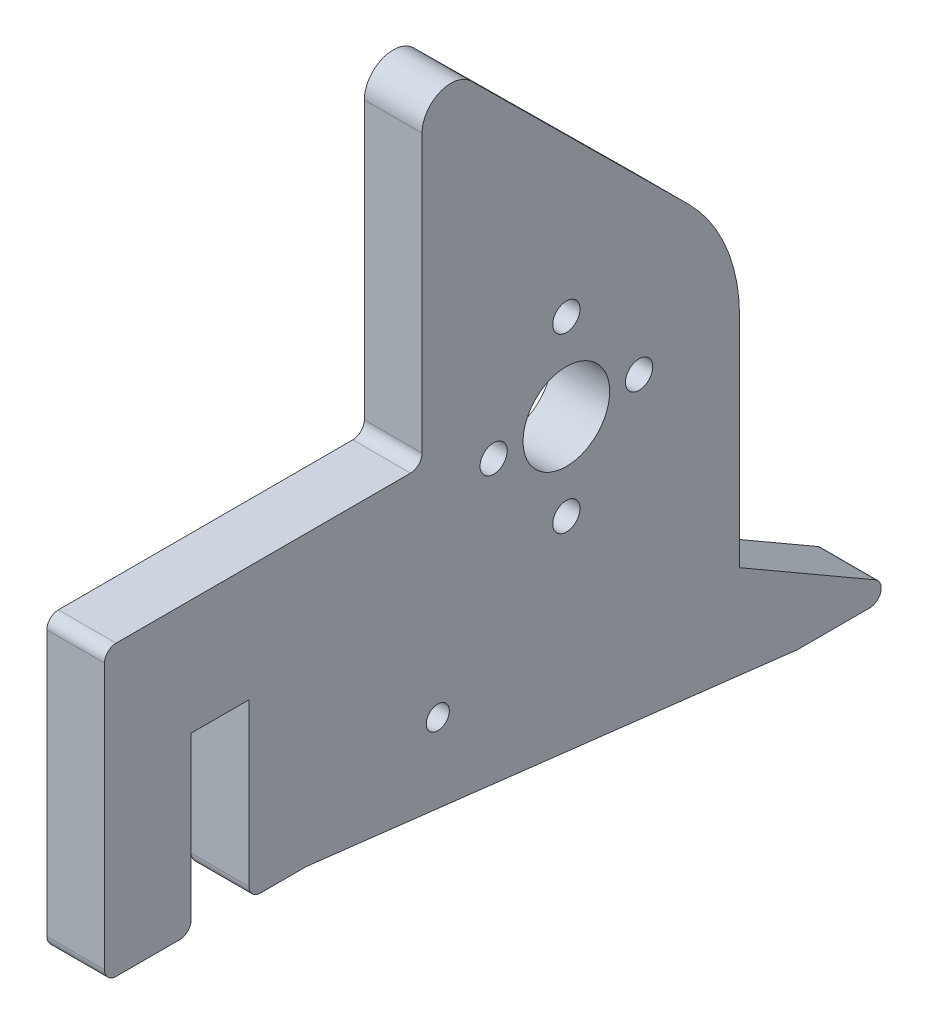
ISO-10303-21;
HEADER;
FILE_DESCRIPTION(('STEP AP214'),'2;1');
FILE_NAME('part.step','',(''),(''),'','','');
FILE_SCHEMA(('AUTOMOTIVE_DESIGN { 1 0 10303 214 1 1 1 1 }'));
ENDSEC;
DATA;
#1=APPLICATION_CONTEXT('core data for automotive mechanical design processes');
#2=APPLICATION_PROTOCOL_DEFINITION('international standard','automotive_design',2000,#1);
#3=PRODUCT_CONTEXT('',#1,'mechanical');
#4=PRODUCT('Part','Part','',(#3));
#5=PRODUCT_RELATED_PRODUCT_CATEGORY('part','',(#4));
#6=PRODUCT_DEFINITION_FORMATION('','',#4);
#7=PRODUCT_DEFINITION_CONTEXT('part definition',#1,'design');
#8=PRODUCT_DEFINITION('design','',#6,#7);
#9=PRODUCT_DEFINITION_SHAPE('','',#8);
#10=(LENGTH_UNIT() NAMED_UNIT(*) SI_UNIT(.MILLI.,.METRE.));
#11=(NAMED_UNIT(*) PLANE_ANGLE_UNIT() SI_UNIT($,.RADIAN.));
#12=(NAMED_UNIT(*) SI_UNIT($,.STERADIAN.) SOLID_ANGLE_UNIT());
#13=UNCERTAINTY_MEASURE_WITH_UNIT(LENGTH_MEASURE(1.E-05),#10,'distance_accuracy_value','');
#14=(GEOMETRIC_REPRESENTATION_CONTEXT(3) GLOBAL_UNCERTAINTY_ASSIGNED_CONTEXT((#13)) GLOBAL_UNIT_ASSIGNED_CONTEXT((#10,
#11,#12)) REPRESENTATION_CONTEXT('',''));
#15=CARTESIAN_POINT('',(0.,0.,0.));
#16=DIRECTION('',(0.,0.,1.));
#17=DIRECTION('',(1.,0.,0.));
#18=AXIS2_PLACEMENT_3D('',#15,#16,#17);
#19=CARTESIAN_POINT('',(3.175,-28.575,50.8));
#20=DIRECTION('',(0.,1.,0.));
#21=DIRECTION('',(0.,0.,1.));
#22=AXIS2_PLACEMENT_3D('',#19,#20,#21);
#23=PLANE('',#22);
#24=DIRECTION('',(0.,0.,-1.));
#25=VECTOR('',#24,1.);
#26=CARTESIAN_POINT('',(-3.175,-28.575,50.8));
#27=LINE('',#26,#25);
#28=CARTESIAN_POINT('',(-3.175,-28.575,49.53));
#29=VERTEX_POINT('',#28);
#30=CARTESIAN_POINT('',(-3.175,-28.575,42.545));
#31=VERTEX_POINT('',#30);
#32=EDGE_CURVE('E259',#29,#31,#27,.T.);
#33=ORIENTED_EDGE('',*,*,#32,.T.);
#34=DIRECTION('',(1.,0.,0.));
#35=VECTOR('',#34,1.);
#36=CARTESIAN_POINT('',(3.175,-28.575,42.545));
#37=LINE('',#36,#35);
#38=CARTESIAN_POINT('',(3.175,-28.575,42.545));
#39=VERTEX_POINT('',#38);
#40=EDGE_CURVE('E316',#31,#39,#37,.T.);
#41=ORIENTED_EDGE('',*,*,#40,.T.);
#42=DIRECTION('',(0.,0.,-1.));
#43=VECTOR('',#42,1.);
#44=CARTESIAN_POINT('',(3.175,-28.575,50.8));
#45=LINE('',#44,#43);
#46=CARTESIAN_POINT('',(3.175,-28.575,49.53));
#47=VERTEX_POINT('',#46);
#48=EDGE_CURVE('E235',#47,#39,#45,.T.);
#49=ORIENTED_EDGE('',*,*,#48,.F.);
#50=DIRECTION('',(-1.,0.,0.));
#51=VECTOR('',#50,1.);
#52=CARTESIAN_POINT('',(3.175,-28.575,49.53));
#53=LINE('',#52,#51);
#54=EDGE_CURVE('E313',#47,#29,#53,.T.);
#55=ORIENTED_EDGE('',*,*,#54,.T.);
#56=EDGE_LOOP('',(#33,#41,#49,#55));
#57=FACE_BOUND('',#56,.T.);
#58=ADVANCED_FACE('F35',(#57),#23,.F.);
#59=CARTESIAN_POINT('',(3.175,-34.925,-38.1));
#60=DIRECTION('',(0.,-0.866025403784442,0.499999999999995));
#61=DIRECTION('',(0.,-0.499999999999995,-0.866025403784442));
#62=AXIS2_PLACEMENT_3D('',#59,#60,#61);
#63=PLANE('',#62);
#64=DIRECTION('',(0.,0.499999999999995,0.866025403784442));
#65=VECTOR('',#64,1.);
#66=CARTESIAN_POINT('',(3.175,-34.925,-38.1));
#67=LINE('',#66,#65);
#68=CARTESIAN_POINT('',(3.175,-32.5551477371938,-33.9952954743875));
#69=VERTEX_POINT('',#68);
#70=CARTESIAN_POINT('',(3.175,-23.9264773719378,-19.05));
#71=VERTEX_POINT('',#70);
#72=EDGE_CURVE('E213',#69,#71,#67,.T.);
#73=ORIENTED_EDGE('',*,*,#72,.F.);
#74=DIRECTION('',(-1.,0.,0.));
#75=VECTOR('',#74,1.);
#76=CARTESIAN_POINT('',(3.175,-32.5551477371938,-33.9952954743875));
#77=LINE('',#76,#75);
#78=CARTESIAN_POINT('',(-3.175,-32.5551477371938,-33.9952954743875));
#79=VERTEX_POINT('',#78);
#80=EDGE_CURVE('E286',#69,#79,#77,.T.);
#81=ORIENTED_EDGE('',*,*,#80,.T.);
#82=DIRECTION('',(0.,0.499999999999995,0.866025403784442));
#83=VECTOR('',#82,1.);
#84=CARTESIAN_POINT('',(-3.175,-34.925,-38.1));
#85=LINE('',#84,#83);
#86=CARTESIAN_POINT('',(-3.175,-23.9264773719378,-19.05));
#87=VERTEX_POINT('',#86);
#88=EDGE_CURVE('E211',#79,#87,#85,.T.);
#89=ORIENTED_EDGE('',*,*,#88,.T.);
#90=DIRECTION('',(-1.,0.,0.));
#91=VECTOR('',#90,1.);
#92=CARTESIAN_POINT('',(3.175,-23.9264773719378,-19.05));
#93=LINE('',#92,#91);
#94=EDGE_CURVE('E283',#71,#87,#93,.T.);
#95=ORIENTED_EDGE('',*,*,#94,.F.);
#96=EDGE_LOOP('',(#73,#81,#89,#95));
#97=FACE_BOUND('',#96,.T.);
#98=ADVANCED_FACE('F366',(#97),#63,.F.);
#99=CARTESIAN_POINT('',(3.175,-23.9264773719378,-19.05));
#100=DIRECTION('',(0.,0.,1.));
#101=DIRECTION('',(1.,0.,0.));
#102=AXIS2_PLACEMENT_3D('',#99,#100,#101);
#103=PLANE('',#102);
#104=DIRECTION('',(0.,1.,0.));
#105=VECTOR('',#104,1.);
#106=CARTESIAN_POINT('',(-3.175,-23.9264773719378,-19.05));
#107=LINE('',#106,#105);
#108=CARTESIAN_POINT('',(-3.175,0.,-19.05));
#109=VERTEX_POINT('',#108);
#110=EDGE_CURVE('E243',#87,#109,#107,.T.);
#111=ORIENTED_EDGE('',*,*,#110,.T.);
#112=DIRECTION('',(-1.,0.,0.));
#113=VECTOR('',#112,1.);
#114=CARTESIAN_POINT('',(3.175,0.,-19.05));
#115=LINE('',#114,#113);
#116=CARTESIAN_POINT('',(3.175,0.,-19.05));
#117=VERTEX_POINT('',#116);
#118=EDGE_CURVE('E280',#117,#109,#115,.T.);
#119=ORIENTED_EDGE('',*,*,#118,.F.);
#120=DIRECTION('',(0.,1.,0.));
#121=VECTOR('',#120,1.);
#122=CARTESIAN_POINT('',(3.175,-23.9264773719378,-19.05));
#123=LINE('',#122,#121);
#124=EDGE_CURVE('E215',#71,#117,#123,.T.);
#125=ORIENTED_EDGE('',*,*,#124,.F.);
#126=ORIENTED_EDGE('',*,*,#94,.T.);
#127=EDGE_LOOP('',(#111,#119,#125,#126));
#128=FACE_BOUND('',#127,.T.);
#129=ADVANCED_FACE('F373',(#128),#103,.F.);
#130=CARTESIAN_POINT('',(3.175,0.,0.));
#131=DIRECTION('',(-1.,0.,0.));
#132=DIRECTION('',(0.,0.,1.));
#133=AXIS2_PLACEMENT_3D('',#130,#131,#132);
#134=CYLINDRICAL_SURFACE('',#133,19.05);
#135=CARTESIAN_POINT('',(-3.175,0.,0.));
#136=DIRECTION('',(1.,0.,0.));
#137=DIRECTION('',(0.,0.,-1.));
#138=AXIS2_PLACEMENT_3D('',#135,#136,#137);
#139=CIRCLE('',#138,19.05);
#140=CARTESIAN_POINT('',(-3.175,13.5341240847627,-13.4063412330974));
#141=VERTEX_POINT('',#140);
#142=EDGE_CURVE('E245',#109,#141,#139,.T.);
#143=ORIENTED_EDGE('',*,*,#142,.T.);
#144=DIRECTION('',(-1.,0.,0.));
#145=VECTOR('',#144,1.);
#146=CARTESIAN_POINT('',(3.175,13.5341240847627,-13.4063412330974));
#147=LINE('',#146,#145);
#148=CARTESIAN_POINT('',(3.175,13.5341240847627,-13.4063412330974));
#149=VERTEX_POINT('',#148);
#150=EDGE_CURVE('E277',#149,#141,#147,.T.);
#151=ORIENTED_EDGE('',*,*,#150,.F.);
#152=CARTESIAN_POINT('',(3.175,0.,0.));
#153=DIRECTION('',(1.,0.,0.));
#154=DIRECTION('',(0.,0.,-1.));
#155=AXIS2_PLACEMENT_3D('',#152,#153,#154);
#156=CIRCLE('',#155,19.05);
#157=EDGE_CURVE('E218',#117,#149,#156,.T.);
#158=ORIENTED_EDGE('',*,*,#157,.F.);
#159=ORIENTED_EDGE('',*,*,#118,.T.);
#160=EDGE_LOOP('',(#143,#151,#158,#159));
#161=FACE_BOUND('',#160,.T.);
#162=ADVANCED_FACE('F431',(#161),#134,.T.);
#163=CARTESIAN_POINT('',(3.175,37.1806873474605,10.4656097944838));
#164=DIRECTION('',(0.,-0.710452707861558,0.703744946619285));
#165=DIRECTION('',(0.,-0.703744946619285,-0.710452707861558));
#166=AXIS2_PLACEMENT_3D('',#163,#164,#165);
#167=PLANE('',#166);
#168=DIRECTION('',(0.,0.703744946619285,0.710452707861558));
#169=VECTOR('',#168,1.);
#170=CARTESIAN_POINT('',(-3.175,37.1806873474605,10.4656097944838));
#171=LINE('',#170,#169);
#172=CARTESIAN_POINT('',(-3.175,37.1806873474605,10.4656097944838));
#173=VERTEX_POINT('',#172);
#174=EDGE_CURVE('E247',#141,#173,#171,.T.);
#175=ORIENTED_EDGE('',*,*,#174,.T.);
#176=DIRECTION('',(-1.,0.,0.));
#177=VECTOR('',#176,1.);
#178=CARTESIAN_POINT('',(3.175,37.1806873474605,10.4656097944838));
#179=LINE('',#178,#177);
#180=CARTESIAN_POINT('',(3.175,37.1806873474605,10.4656097944838));
#181=VERTEX_POINT('',#180);
#182=EDGE_CURVE('E274',#181,#173,#179,.T.);
#183=ORIENTED_EDGE('',*,*,#182,.F.);
#184=DIRECTION('',(0.,0.703744946619285,0.710452707861558));
#185=VECTOR('',#184,1.);
#186=CARTESIAN_POINT('',(3.175,37.1806873474605,10.4656097944838));
#187=LINE('',#186,#185);
#188=EDGE_CURVE('E220',#149,#181,#187,.T.);
#189=ORIENTED_EDGE('',*,*,#188,.F.);
#190=ORIENTED_EDGE('',*,*,#150,.T.);
#191=EDGE_LOOP('',(#175,#183,#189,#190));
#192=FACE_BOUND('',#191,.T.);
#193=ADVANCED_FACE('F435',(#192),#167,.F.);
#194=CARTESIAN_POINT('',(3.175,34.925,12.7));
#195=DIRECTION('',(-1.,0.,0.));
#196=DIRECTION('',(0.,0.,1.));
#197=AXIS2_PLACEMENT_3D('',#194,#195,#196);
#198=CYLINDRICAL_SURFACE('',#197,3.175);
#199=CARTESIAN_POINT('',(-3.175,34.925,12.7));
#200=DIRECTION('',(1.,0.,0.));
#201=DIRECTION('',(0.,0.,-1.));
#202=AXIS2_PLACEMENT_3D('',#199,#200,#201);
#203=CIRCLE('',#202,3.175);
#204=CARTESIAN_POINT('',(-3.175,34.925,15.875));
#205=VERTEX_POINT('',#204);
#206=EDGE_CURVE('E249',#173,#205,#203,.T.);
#207=ORIENTED_EDGE('',*,*,#206,.T.);
#208=DIRECTION('',(-1.,0.,0.));
#209=VECTOR('',#208,1.);
#210=CARTESIAN_POINT('',(3.175,34.925,15.875));
#211=LINE('',#210,#209);
#212=CARTESIAN_POINT('',(3.175,34.925,15.875));
#213=VERTEX_POINT('',#212);
#214=EDGE_CURVE('E271',#213,#205,#211,.T.);
#215=ORIENTED_EDGE('',*,*,#214,.F.);
#216=CARTESIAN_POINT('',(3.175,34.925,12.7));
#217=DIRECTION('',(1.,0.,0.));
#218=DIRECTION('',(0.,0.,-1.));
#219=AXIS2_PLACEMENT_3D('',#216,#217,#218);
#220=CIRCLE('',#219,3.175);
#221=EDGE_CURVE('E222',#181,#213,#220,.T.);
#222=ORIENTED_EDGE('',*,*,#221,.F.);
#223=ORIENTED_EDGE('',*,*,#182,.T.);
#224=EDGE_LOOP('',(#207,#215,#222,#223));
#225=FACE_BOUND('',#224,.T.);
#226=ADVANCED_FACE('F439',(#225),#198,.T.);
#227=CARTESIAN_POINT('',(3.175,3.175,15.875));
#228=DIRECTION('',(0.,0.,-1.));
#229=DIRECTION('',(0.,1.,0.));
#230=AXIS2_PLACEMENT_3D('',#227,#228,#229);
#231=PLANE('',#230);
#232=DIRECTION('',(0.,-1.,0.));
#233=VECTOR('',#232,1.);
#234=CARTESIAN_POINT('',(-3.175,3.175,15.875));
#235=LINE('',#234,#233);
#236=CARTESIAN_POINT('',(-3.175,4.445,15.875));
#237=VERTEX_POINT('',#236);
#238=EDGE_CURVE('E251',#205,#237,#235,.T.);
#239=ORIENTED_EDGE('',*,*,#238,.T.);
#240=DIRECTION('',(-1.,0.,0.));
#241=VECTOR('',#240,1.);
#242=CARTESIAN_POINT('',(3.175,4.445,15.875));
#243=LINE('',#242,#241);
#244=CARTESIAN_POINT('',(3.175,4.445,15.875));
#245=VERTEX_POINT('',#244);
#246=EDGE_CURVE('E331',#237,#245,#243,.F.);
#247=ORIENTED_EDGE('',*,*,#246,.T.);
#248=DIRECTION('',(0.,-1.,0.));
#249=VECTOR('',#248,1.);
#250=CARTESIAN_POINT('',(3.175,3.175,15.875));
#251=LINE('',#250,#249);
#252=EDGE_CURVE('E224',#213,#245,#251,.T.);
#253=ORIENTED_EDGE('',*,*,#252,.F.);
#254=ORIENTED_EDGE('',*,*,#214,.T.);
#255=EDGE_LOOP('',(#239,#247,#253,#254));
#256=FACE_BOUND('',#255,.T.);
#257=ADVANCED_FACE('F335',(#256),#231,.F.);
#258=CARTESIAN_POINT('',(3.175,3.175,50.8));
#259=DIRECTION('',(0.,-1.,0.));
#260=DIRECTION('',(0.,0.,-1.));
#261=AXIS2_PLACEMENT_3D('',#258,#259,#260);
#262=PLANE('',#261);
#263=DIRECTION('',(0.,0.,1.));
#264=VECTOR('',#263,1.);
#265=CARTESIAN_POINT('',(-3.175,3.175,50.8));
#266=LINE('',#265,#264);
#267=CARTESIAN_POINT('',(-3.175,3.175,17.145));
#268=VERTEX_POINT('',#267);
#269=CARTESIAN_POINT('',(-3.175,3.175,49.53));
#270=VERTEX_POINT('',#269);
#271=EDGE_CURVE('E253',#268,#270,#266,.T.);
#272=ORIENTED_EDGE('',*,*,#271,.T.);
#273=DIRECTION('',(-1.,0.,0.));
#274=VECTOR('',#273,1.);
#275=CARTESIAN_POINT('',(3.175,3.175,49.53));
#276=LINE('',#275,#274);
#277=CARTESIAN_POINT('',(3.175,3.175,49.53));
#278=VERTEX_POINT('',#277);
#279=EDGE_CURVE('E329',#270,#278,#276,.F.);
#280=ORIENTED_EDGE('',*,*,#279,.T.);
#281=DIRECTION('',(0.,0.,1.));
#282=VECTOR('',#281,1.);
#283=CARTESIAN_POINT('',(3.175,3.175,50.8));
#284=LINE('',#283,#282);
#285=CARTESIAN_POINT('',(3.175,3.175,17.145));
#286=VERTEX_POINT('',#285);
#287=EDGE_CURVE('E227',#286,#278,#284,.T.);
#288=ORIENTED_EDGE('',*,*,#287,.F.);
#289=DIRECTION('',(-1.,0.,0.));
#290=VECTOR('',#289,1.);
#291=CARTESIAN_POINT('',(-3.175,3.175,17.145));
#292=LINE('',#291,#290);
#293=EDGE_CURVE('E326',#286,#268,#292,.T.);
#294=ORIENTED_EDGE('',*,*,#293,.T.);
#295=EDGE_LOOP('',(#272,#280,#288,#294));
#296=FACE_BOUND('',#295,.T.);
#297=ADVANCED_FACE('F343',(#296),#262,.F.);
#298=CARTESIAN_POINT('',(3.175,-28.575,50.8));
#299=DIRECTION('',(0.,0.,-1.));
#300=DIRECTION('',(-1.,0.,0.));
#301=AXIS2_PLACEMENT_3D('',#298,#299,#300);
#302=PLANE('',#301);
#303=DIRECTION('',(0.,-1.,0.));
#304=VECTOR('',#303,1.);
#305=CARTESIAN_POINT('',(-3.175,-28.575,50.8));
#306=LINE('',#305,#304);
#307=CARTESIAN_POINT('',(-3.175,1.905,50.8));
#308=VERTEX_POINT('',#307);
#309=CARTESIAN_POINT('',(-3.175,-27.305,50.8));
#310=VERTEX_POINT('',#309);
#311=EDGE_CURVE('E255',#308,#310,#306,.T.);
#312=ORIENTED_EDGE('',*,*,#311,.T.);
#313=DIRECTION('',(-1.,0.,0.));
#314=VECTOR('',#313,1.);
#315=CARTESIAN_POINT('',(3.175,-27.305,50.8));
#316=LINE('',#315,#314);
#317=CARTESIAN_POINT('',(3.175,-27.305,50.8));
#318=VERTEX_POINT('',#317);
#319=EDGE_CURVE('E324',#310,#318,#316,.F.);
#320=ORIENTED_EDGE('',*,*,#319,.T.);
#321=DIRECTION('',(0.,-1.,0.));
#322=VECTOR('',#321,1.);
#323=CARTESIAN_POINT('',(3.175,-28.575,50.8));
#324=LINE('',#323,#322);
#325=CARTESIAN_POINT('',(3.175,1.905,50.8));
#326=VERTEX_POINT('',#325);
#327=EDGE_CURVE('E230',#326,#318,#324,.T.);
#328=ORIENTED_EDGE('',*,*,#327,.F.);
#329=DIRECTION('',(-1.,0.,0.));
#330=VECTOR('',#329,1.);
#331=CARTESIAN_POINT('',(3.175,1.905,50.8));
#332=LINE('',#331,#330);
#333=EDGE_CURVE('E321',#326,#308,#332,.T.);
#334=ORIENTED_EDGE('',*,*,#333,.T.);
#335=EDGE_LOOP('',(#312,#320,#328,#334));
#336=FACE_BOUND('',#335,.T.);
#337=ADVANCED_FACE('F380',(#336),#302,.F.);
#338=CARTESIAN_POINT('',(3.175,-28.575,33.655));
#339=VERTEX_POINT('',#338);
#340=CARTESIAN_POINT('',(3.175,-28.575,28.575));
#341=VERTEX_POINT('',#340);
#342=EDGE_CURVE('E233',#339,#341,#45,.T.);
#343=ORIENTED_EDGE('',*,*,#342,.F.);
#344=DIRECTION('',(1.,0.,0.));
#345=VECTOR('',#344,1.);
#346=CARTESIAN_POINT('',(3.175,-28.575,33.655));
#347=LINE('',#346,#345);
#348=CARTESIAN_POINT('',(-3.175,-28.575,33.655));
#349=VERTEX_POINT('',#348);
#350=EDGE_CURVE('E304',#339,#349,#347,.F.);
#351=ORIENTED_EDGE('',*,*,#350,.T.);
#352=CARTESIAN_POINT('',(-3.175,-28.575,28.575));
#353=VERTEX_POINT('',#352);
#354=EDGE_CURVE('E258',#349,#353,#27,.T.);
#355=ORIENTED_EDGE('',*,*,#354,.T.);
#356=DIRECTION('',(-1.,0.,0.));
#357=VECTOR('',#356,1.);
#358=CARTESIAN_POINT('',(3.175,-28.575,28.575));
#359=LINE('',#358,#357);
#360=EDGE_CURVE('E268',#341,#353,#359,.T.);
#361=ORIENTED_EDGE('',*,*,#360,.F.);
#362=EDGE_LOOP('',(#343,#351,#355,#361));
#363=FACE_BOUND('',#362,.T.);
#364=ADVANCED_FACE('F369',(#363),#23,.F.);
#365=CARTESIAN_POINT('',(3.175,-28.575,28.575));
#366=DIRECTION('',(0.,0.993150604322876,-0.116841247567397));
#367=DIRECTION('',(0.,0.116841247567397,0.993150604322876));
#368=AXIS2_PLACEMENT_3D('',#365,#366,#367);
#369=PLANE('',#368);
#370=DIRECTION('',(0.,-0.116841247567397,-0.993150604322876));
#371=VECTOR('',#370,1.);
#372=CARTESIAN_POINT('',(-3.175,-28.575,28.575));
#373=LINE('',#372,#371);
#374=CARTESIAN_POINT('',(-3.175,-34.925,-25.4));
#375=VERTEX_POINT('',#374);
#376=EDGE_CURVE('E262',#353,#375,#373,.T.);
#377=ORIENTED_EDGE('',*,*,#376,.T.);
#378=DIRECTION('',(-1.,0.,0.));
#379=VECTOR('',#378,1.);
#380=CARTESIAN_POINT('',(3.175,-34.925,-25.4));
#381=LINE('',#380,#379);
#382=CARTESIAN_POINT('',(3.175,-34.925,-25.4));
#383=VERTEX_POINT('',#382);
#384=EDGE_CURVE('E241',#383,#375,#381,.T.);
#385=ORIENTED_EDGE('',*,*,#384,.F.);
#386=DIRECTION('',(0.,-0.116841247567397,-0.993150604322876));
#387=VECTOR('',#386,1.);
#388=CARTESIAN_POINT('',(3.175,-28.575,28.575));
#389=LINE('',#388,#387);
#390=EDGE_CURVE('E236',#341,#383,#389,.T.);
#391=ORIENTED_EDGE('',*,*,#390,.F.);
#392=ORIENTED_EDGE('',*,*,#360,.T.);
#393=EDGE_LOOP('',(#377,#385,#391,#392));
#394=FACE_BOUND('',#393,.T.);
#395=ADVANCED_FACE('F379',(#394),#369,.F.);
#396=CARTESIAN_POINT('',(3.175,-34.925,-25.4));
#397=DIRECTION('',(0.,1.,0.));
#398=DIRECTION('',(0.,0.,1.));
#399=AXIS2_PLACEMENT_3D('',#396,#397,#398);
#400=PLANE('',#399);
#401=DIRECTION('',(0.,0.,-1.));
#402=VECTOR('',#401,1.);
#403=CARTESIAN_POINT('',(-3.175,-34.925,-25.4));
#404=LINE('',#403,#402);
#405=CARTESIAN_POINT('',(-3.175,-34.925,-33.3602954743875));
#406=VERTEX_POINT('',#405);
#407=EDGE_CURVE('E216',#375,#406,#404,.T.);
#408=ORIENTED_EDGE('',*,*,#407,.T.);
#409=DIRECTION('',(-1.,0.,0.));
#410=VECTOR('',#409,1.);
#411=CARTESIAN_POINT('',(3.175,-34.925,-33.3602954743875));
#412=LINE('',#411,#410);
#413=CARTESIAN_POINT('',(3.175,-34.925,-33.3602954743875));
#414=VERTEX_POINT('',#413);
#415=EDGE_CURVE('E291',#406,#414,#412,.F.);
#416=ORIENTED_EDGE('',*,*,#415,.T.);
#417=DIRECTION('',(0.,0.,-1.));
#418=VECTOR('',#417,1.);
#419=CARTESIAN_POINT('',(3.175,-34.925,-25.4));
#420=LINE('',#419,#418);
#421=EDGE_CURVE('E238',#383,#414,#420,.T.);
#422=ORIENTED_EDGE('',*,*,#421,.F.);
#423=ORIENTED_EDGE('',*,*,#384,.T.);
#424=EDGE_LOOP('',(#408,#416,#422,#423));
#425=FACE_BOUND('',#424,.T.);
#426=ADVANCED_FACE('F359',(#425),#400,.F.);
#427=CARTESIAN_POINT('',(3.175,0.,0.));
#428=DIRECTION('',(1.,0.,0.));
#429=DIRECTION('',(0.,0.,-1.));
#430=AXIS2_PLACEMENT_3D('',#427,#428,#429);
#431=PLANE('',#430);
#432=CARTESIAN_POINT('',(3.175,-21.59,14.14272));
#433=DIRECTION('',(-1.,0.,0.));
#434=DIRECTION('',(0.,0.,1.));
#435=AXIS2_PLACEMENT_3D('',#432,#433,#434);
#436=CIRCLE('',#435,1.27);
#437=CARTESIAN_POINT('',(3.175,-21.59,15.41272));
#438=VERTEX_POINT('',#437);
#439=EDGE_CURVE('E695',#438,#438,#436,.T.);
#440=ORIENTED_EDGE('',*,*,#439,.T.);
#441=EDGE_LOOP('',(#440));
#442=FACE_BOUND('',#441,.T.);
#443=CARTESIAN_POINT('',(3.175,-9.5,0.));
#444=DIRECTION('',(1.,0.,0.));
#445=DIRECTION('',(0.,0.,-1.));
#446=AXIS2_PLACEMENT_3D('',#443,#444,#445);
#447=CIRCLE('',#446,1.5);
#448=CARTESIAN_POINT('',(3.175,-9.5,-1.5));
#449=VERTEX_POINT('',#448);
#450=EDGE_CURVE('E671',#449,#449,#447,.T.);
#451=ORIENTED_EDGE('',*,*,#450,.F.);
#452=EDGE_LOOP('',(#451));
#453=FACE_BOUND('',#452,.T.);
#454=CARTESIAN_POINT('',(3.175,0.,0.));
#455=DIRECTION('',(1.,0.,0.));
#456=DIRECTION('',(0.,0.,-1.));
#457=AXIS2_PLACEMENT_3D('',#454,#455,#456);
#458=CIRCLE('',#457,4.7625);
#459=CARTESIAN_POINT('',(3.175,0.,-4.7625));
#460=VERTEX_POINT('',#459);
#461=EDGE_CURVE('E693',#460,#460,#458,.T.);
#462=ORIENTED_EDGE('',*,*,#461,.F.);
#463=EDGE_LOOP('',(#462));
#464=FACE_BOUND('',#463,.T.);
#465=CARTESIAN_POINT('',(3.175,0.,8.));
#466=DIRECTION('',(1.,0.,0.));
#467=DIRECTION('',(0.,0.,-1.));
#468=AXIS2_PLACEMENT_3D('',#465,#466,#467);
#469=CIRCLE('',#468,1.5);
#470=CARTESIAN_POINT('',(3.175,0.,6.5));
#471=VERTEX_POINT('',#470);
#472=EDGE_CURVE('E682',#471,#471,#469,.T.);
#473=ORIENTED_EDGE('',*,*,#472,.F.);
#474=EDGE_LOOP('',(#473));
#475=FACE_BOUND('',#474,.T.);
#476=CARTESIAN_POINT('',(3.175,0.,-8.));
#477=DIRECTION('',(1.,0.,0.));
#478=DIRECTION('',(0.,0.,-1.));
#479=AXIS2_PLACEMENT_3D('',#476,#477,#478);
#480=CIRCLE('',#479,1.5);
#481=CARTESIAN_POINT('',(3.175,0.,-9.5));
#482=VERTEX_POINT('',#481);
#483=EDGE_CURVE('E674',#482,#482,#480,.T.);
#484=ORIENTED_EDGE('',*,*,#483,.F.);
#485=EDGE_LOOP('',(#484));
#486=FACE_BOUND('',#485,.T.);
#487=CARTESIAN_POINT('',(3.175,9.5,0.));
#488=DIRECTION('',(1.,0.,0.));
#489=DIRECTION('',(0.,0.,-1.));
#490=AXIS2_PLACEMENT_3D('',#487,#488,#489);
#491=CIRCLE('',#490,1.5);
#492=CARTESIAN_POINT('',(3.175,9.5,-1.5));
#493=VERTEX_POINT('',#492);
#494=EDGE_CURVE('E667',#493,#493,#491,.T.);
#495=ORIENTED_EDGE('',*,*,#494,.F.);
#496=EDGE_LOOP('',(#495));
#497=FACE_BOUND('',#496,.T.);
#498=DIRECTION('',(0.,1.,0.));
#499=VECTOR('',#498,1.);
#500=CARTESIAN_POINT('',(3.175,-9.525,34.925));
#501=LINE('',#500,#499);
#502=CARTESIAN_POINT('',(3.175,-27.305,34.925));
#503=VERTEX_POINT('',#502);
#504=CARTESIAN_POINT('',(3.175,-9.525,34.925));
#505=VERTEX_POINT('',#504);
#506=EDGE_CURVE('E177',#503,#505,#501,.T.);
#507=ORIENTED_EDGE('',*,*,#506,.F.);
#508=CARTESIAN_POINT('',(3.175,-27.305,33.655));
#509=DIRECTION('',(1.,0.,0.));
#510=DIRECTION('',(0.,0.,-1.));
#511=AXIS2_PLACEMENT_3D('',#508,#509,#510);
#512=CIRCLE('',#511,1.27);
#513=EDGE_CURVE('E302',#503,#339,#512,.T.);
#514=ORIENTED_EDGE('',*,*,#513,.T.);
#515=ORIENTED_EDGE('',*,*,#342,.T.);
#516=ORIENTED_EDGE('',*,*,#390,.T.);
#517=ORIENTED_EDGE('',*,*,#421,.T.);
#518=CARTESIAN_POINT('',(3.175,-33.655,-33.3602954743875));
#519=DIRECTION('',(1.,0.,0.));
#520=DIRECTION('',(0.,0.,-1.));
#521=AXIS2_PLACEMENT_3D('',#518,#519,#520);
#522=CIRCLE('',#521,1.27);
#523=EDGE_CURVE('E293',#414,#69,#522,.T.);
#524=ORIENTED_EDGE('',*,*,#523,.T.);
#525=ORIENTED_EDGE('',*,*,#72,.T.);
#526=ORIENTED_EDGE('',*,*,#124,.T.);
#527=ORIENTED_EDGE('',*,*,#157,.T.);
#528=ORIENTED_EDGE('',*,*,#188,.T.);
#529=ORIENTED_EDGE('',*,*,#221,.T.);
#530=ORIENTED_EDGE('',*,*,#252,.T.);
#531=CARTESIAN_POINT('',(3.175,4.445,17.145));
#532=DIRECTION('',(1.,0.,0.));
#533=DIRECTION('',(0.,0.,-1.));
#534=AXIS2_PLACEMENT_3D('',#531,#532,#533);
#535=CIRCLE('',#534,1.27);
#536=EDGE_CURVE('E11',#245,#286,#535,.F.);
#537=ORIENTED_EDGE('',*,*,#536,.T.);
#538=ORIENTED_EDGE('',*,*,#287,.T.);
#539=CARTESIAN_POINT('',(3.175,1.905,49.53));
#540=DIRECTION('',(1.,0.,0.));
#541=DIRECTION('',(0.,0.,-1.));
#542=AXIS2_PLACEMENT_3D('',#539,#540,#541);
#543=CIRCLE('',#542,1.27);
#544=EDGE_CURVE('E296',#278,#326,#543,.T.);
#545=ORIENTED_EDGE('',*,*,#544,.T.);
#546=ORIENTED_EDGE('',*,*,#327,.T.);
#547=CARTESIAN_POINT('',(3.175,-27.305,49.53));
#548=DIRECTION('',(1.,0.,0.));
#549=DIRECTION('',(0.,0.,-1.));
#550=AXIS2_PLACEMENT_3D('',#547,#548,#549);
#551=CIRCLE('',#550,1.27);
#552=EDGE_CURVE('E298',#318,#47,#551,.T.);
#553=ORIENTED_EDGE('',*,*,#552,.T.);
#554=ORIENTED_EDGE('',*,*,#48,.T.);
#555=CARTESIAN_POINT('',(3.175,-27.305,42.545));
#556=DIRECTION('',(1.,0.,0.));
#557=DIRECTION('',(0.,0.,-1.));
#558=AXIS2_PLACEMENT_3D('',#555,#556,#557);
#559=CIRCLE('',#558,1.27);
#560=CARTESIAN_POINT('',(3.175,-27.305,41.275));
#561=VERTEX_POINT('',#560);
#562=EDGE_CURVE('E300',#39,#561,#559,.T.);
#563=ORIENTED_EDGE('',*,*,#562,.T.);
#564=DIRECTION('',(0.,-1.,0.));
#565=VECTOR('',#564,1.);
#566=CARTESIAN_POINT('',(3.175,-28.575,41.275));
#567=LINE('',#566,#565);
#568=CARTESIAN_POINT('',(3.175,-9.525,41.275));
#569=VERTEX_POINT('',#568);
#570=EDGE_CURVE('E201',#569,#561,#567,.T.);
#571=ORIENTED_EDGE('',*,*,#570,.F.);
#572=DIRECTION('',(0.,0.,1.));
#573=VECTOR('',#572,1.);
#574=CARTESIAN_POINT('',(3.175,-9.525,41.275));
#575=LINE('',#574,#573);
#576=EDGE_CURVE('E186',#505,#569,#575,.T.);
#577=ORIENTED_EDGE('',*,*,#576,.F.);
#578=EDGE_LOOP('',(#507,#514,#515,#516,#517,#524,#525,#526,#527,#528,#529,#530,#537,#538,#545,
#546,#553,#554,#563,#571,#577));
#579=FACE_BOUND('',#578,.T.);
#580=ADVANCED_FACE('F199',(#442,#453,#464,#475,#486,#497,#579),#431,.T.);
#581=CARTESIAN_POINT('',(-3.175,0.,0.));
#582=DIRECTION('',(1.,0.,0.));
#583=DIRECTION('',(0.,0.,-1.));
#584=AXIS2_PLACEMENT_3D('',#581,#582,#583);
#585=PLANE('',#584);
#586=CARTESIAN_POINT('',(-3.175,-21.59,14.14272));
#587=DIRECTION('',(-1.,0.,0.));
#588=DIRECTION('',(0.,0.,1.));
#589=AXIS2_PLACEMENT_3D('',#586,#587,#588);
#590=CIRCLE('',#589,1.27);
#591=CARTESIAN_POINT('',(-3.175,-21.59,15.41272));
#592=VERTEX_POINT('',#591);
#593=EDGE_CURVE('E699',#592,#592,#590,.T.);
#594=ORIENTED_EDGE('',*,*,#593,.F.);
#595=EDGE_LOOP('',(#594));
#596=FACE_BOUND('',#595,.T.);
#597=CARTESIAN_POINT('',(-3.175,-9.5,0.));
#598=DIRECTION('',(1.,0.,0.));
#599=DIRECTION('',(0.,0.,-1.));
#600=AXIS2_PLACEMENT_3D('',#597,#598,#599);
#601=CIRCLE('',#600,1.5);
#602=CARTESIAN_POINT('',(-3.175,-9.5,-1.5));
#603=VERTEX_POINT('',#602);
#604=EDGE_CURVE('E187',#603,#603,#601,.T.);
#605=ORIENTED_EDGE('',*,*,#604,.T.);
#606=EDGE_LOOP('',(#605));
#607=FACE_BOUND('',#606,.T.);
#608=CARTESIAN_POINT('',(-3.175,0.,0.));
#609=DIRECTION('',(1.,0.,0.));
#610=DIRECTION('',(0.,0.,-1.));
#611=AXIS2_PLACEMENT_3D('',#608,#609,#610);
#612=CIRCLE('',#611,4.7625);
#613=CARTESIAN_POINT('',(-3.175,0.,-4.7625));
#614=VERTEX_POINT('',#613);
#615=EDGE_CURVE('E687',#614,#614,#612,.T.);
#616=ORIENTED_EDGE('',*,*,#615,.T.);
#617=EDGE_LOOP('',(#616));
#618=FACE_BOUND('',#617,.T.);
#619=CARTESIAN_POINT('',(-3.175,0.,8.));
#620=DIRECTION('',(1.,0.,0.));
#621=DIRECTION('',(0.,0.,-1.));
#622=AXIS2_PLACEMENT_3D('',#619,#620,#621);
#623=CIRCLE('',#622,1.5);
#624=CARTESIAN_POINT('',(-3.175,0.,6.5));
#625=VERTEX_POINT('',#624);
#626=EDGE_CURVE('E678',#625,#625,#623,.T.);
#627=ORIENTED_EDGE('',*,*,#626,.T.);
#628=EDGE_LOOP('',(#627));
#629=FACE_BOUND('',#628,.T.);
#630=CARTESIAN_POINT('',(-3.175,0.,-8.));
#631=DIRECTION('',(1.,0.,0.));
#632=DIRECTION('',(0.,0.,-1.));
#633=AXIS2_PLACEMENT_3D('',#630,#631,#632);
#634=CIRCLE('',#633,1.5);
#635=CARTESIAN_POINT('',(-3.175,0.,-9.5));
#636=VERTEX_POINT('',#635);
#637=EDGE_CURVE('E669',#636,#636,#634,.T.);
#638=ORIENTED_EDGE('',*,*,#637,.T.);
#639=EDGE_LOOP('',(#638));
#640=FACE_BOUND('',#639,.T.);
#641=CARTESIAN_POINT('',(-3.175,9.5,0.));
#642=DIRECTION('',(1.,0.,0.));
#643=DIRECTION('',(0.,0.,-1.));
#644=AXIS2_PLACEMENT_3D('',#641,#642,#643);
#645=CIRCLE('',#644,1.5);
#646=CARTESIAN_POINT('',(-3.175,9.5,-1.5));
#647=VERTEX_POINT('',#646);
#648=EDGE_CURVE('E664',#647,#647,#645,.T.);
#649=ORIENTED_EDGE('',*,*,#648,.T.);
#650=EDGE_LOOP('',(#649));
#651=FACE_BOUND('',#650,.T.);
#652=ORIENTED_EDGE('',*,*,#354,.F.);
#653=CARTESIAN_POINT('',(-3.175,-27.305,33.655));
#654=DIRECTION('',(1.,0.,0.));
#655=DIRECTION('',(0.,0.,-1.));
#656=AXIS2_PLACEMENT_3D('',#653,#654,#655);
#657=CIRCLE('',#656,1.27);
#658=CARTESIAN_POINT('',(-3.175,-27.305,34.925));
#659=VERTEX_POINT('',#658);
#660=EDGE_CURVE('E311',#349,#659,#657,.F.);
#661=ORIENTED_EDGE('',*,*,#660,.T.);
#662=DIRECTION('',(0.,1.,0.));
#663=VECTOR('',#662,1.);
#664=CARTESIAN_POINT('',(-3.175,-9.525,34.925));
#665=LINE('',#664,#663);
#666=CARTESIAN_POINT('',(-3.175,-9.525,34.925));
#667=VERTEX_POINT('',#666);
#668=EDGE_CURVE('E203',#659,#667,#665,.T.);
#669=ORIENTED_EDGE('',*,*,#668,.T.);
#670=DIRECTION('',(0.,0.,1.));
#671=VECTOR('',#670,1.);
#672=CARTESIAN_POINT('',(-3.175,-9.525,41.275));
#673=LINE('',#672,#671);
#674=CARTESIAN_POINT('',(-3.175,-9.525,41.275));
#675=VERTEX_POINT('',#674);
#676=EDGE_CURVE('E195',#667,#675,#673,.T.);
#677=ORIENTED_EDGE('',*,*,#676,.T.);
#678=DIRECTION('',(0.,-1.,0.));
#679=VECTOR('',#678,1.);
#680=CARTESIAN_POINT('',(-3.175,-28.575,41.275));
#681=LINE('',#680,#679);
#682=CARTESIAN_POINT('',(-3.175,-27.305,41.275));
#683=VERTEX_POINT('',#682);
#684=EDGE_CURVE('E197',#675,#683,#681,.T.);
#685=ORIENTED_EDGE('',*,*,#684,.T.);
#686=CARTESIAN_POINT('',(-3.175,-27.305,42.545));
#687=DIRECTION('',(1.,0.,0.));
#688=DIRECTION('',(0.,0.,-1.));
#689=AXIS2_PLACEMENT_3D('',#686,#687,#688);
#690=CIRCLE('',#689,1.27);
#691=EDGE_CURVE('E309',#683,#31,#690,.F.);
#692=ORIENTED_EDGE('',*,*,#691,.T.);
#693=ORIENTED_EDGE('',*,*,#32,.F.);
#694=CARTESIAN_POINT('',(-3.175,-27.305,49.53));
#695=DIRECTION('',(1.,0.,0.));
#696=DIRECTION('',(0.,0.,-1.));
#697=AXIS2_PLACEMENT_3D('',#694,#695,#696);
#698=CIRCLE('',#697,1.27);
#699=EDGE_CURVE('E307',#29,#310,#698,.F.);
#700=ORIENTED_EDGE('',*,*,#699,.T.);
#701=ORIENTED_EDGE('',*,*,#311,.F.);
#702=CARTESIAN_POINT('',(-3.175,1.905,49.53));
#703=DIRECTION('',(1.,0.,0.));
#704=DIRECTION('',(0.,0.,-1.));
#705=AXIS2_PLACEMENT_3D('',#702,#703,#704);
#706=CIRCLE('',#705,1.27);
#707=EDGE_CURVE('E55',#308,#270,#706,.F.);
#708=ORIENTED_EDGE('',*,*,#707,.T.);
#709=ORIENTED_EDGE('',*,*,#271,.F.);
#710=CARTESIAN_POINT('',(-3.175,4.445,17.145));
#711=DIRECTION('',(1.,0.,0.));
#712=DIRECTION('',(0.,0.,-1.));
#713=AXIS2_PLACEMENT_3D('',#710,#711,#712);
#714=CIRCLE('',#713,1.27);
#715=EDGE_CURVE('E43',#268,#237,#714,.T.);
#716=ORIENTED_EDGE('',*,*,#715,.T.);
#717=ORIENTED_EDGE('',*,*,#238,.F.);
#718=ORIENTED_EDGE('',*,*,#206,.F.);
#719=ORIENTED_EDGE('',*,*,#174,.F.);
#720=ORIENTED_EDGE('',*,*,#142,.F.);
#721=ORIENTED_EDGE('',*,*,#110,.F.);
#722=ORIENTED_EDGE('',*,*,#88,.F.);
#723=CARTESIAN_POINT('',(-3.175,-33.655,-33.3602954743875));
#724=DIRECTION('',(1.,0.,0.));
#725=DIRECTION('',(0.,0.,-1.));
#726=AXIS2_PLACEMENT_3D('',#723,#724,#725);
#727=CIRCLE('',#726,1.27);
#728=EDGE_CURVE('E289',#79,#406,#727,.F.);
#729=ORIENTED_EDGE('',*,*,#728,.T.);
#730=ORIENTED_EDGE('',*,*,#407,.F.);
#731=ORIENTED_EDGE('',*,*,#376,.F.);
#732=EDGE_LOOP('',(#652,#661,#669,#677,#685,#692,#693,#700,#701,#708,#709,#716,#717,#718,#719,
#720,#721,#722,#729,#730,#731));
#733=FACE_BOUND('',#732,.T.);
#734=ADVANCED_FACE('F346',(#596,#607,#618,#629,#640,#651,#733),#585,.F.);
#735=CARTESIAN_POINT('',(-3.175,-28.575,41.275));
#736=DIRECTION('',(0.,0.,1.));
#737=DIRECTION('',(1.,0.,0.));
#738=AXIS2_PLACEMENT_3D('',#735,#736,#737);
#739=PLANE('',#738);
#740=ORIENTED_EDGE('',*,*,#570,.T.);
#741=DIRECTION('',(1.,0.,0.));
#742=VECTOR('',#741,1.);
#743=CARTESIAN_POINT('',(-3.175,-27.305,41.275));
#744=LINE('',#743,#742);
#745=EDGE_CURVE('E319',#561,#683,#744,.F.);
#746=ORIENTED_EDGE('',*,*,#745,.T.);
#747=ORIENTED_EDGE('',*,*,#684,.F.);
#748=DIRECTION('',(1.,0.,0.));
#749=VECTOR('',#748,1.);
#750=CARTESIAN_POINT('',(-3.175,-9.525,41.275));
#751=LINE('',#750,#749);
#752=EDGE_CURVE('E196',#675,#569,#751,.T.);
#753=ORIENTED_EDGE('',*,*,#752,.T.);
#754=EDGE_LOOP('',(#740,#746,#747,#753));
#755=FACE_BOUND('',#754,.T.);
#756=ADVANCED_FACE('F350',(#755),#739,.F.);
#757=CARTESIAN_POINT('',(-3.175,-9.525,41.275));
#758=DIRECTION('',(0.,1.,0.));
#759=DIRECTION('',(0.,0.,1.));
#760=AXIS2_PLACEMENT_3D('',#757,#758,#759);
#761=PLANE('',#760);
#762=ORIENTED_EDGE('',*,*,#752,.F.);
#763=ORIENTED_EDGE('',*,*,#676,.F.);
#764=DIRECTION('',(1.,0.,0.));
#765=VECTOR('',#764,1.);
#766=CARTESIAN_POINT('',(-3.175,-9.525,34.925));
#767=LINE('',#766,#765);
#768=EDGE_CURVE('E181',#667,#505,#767,.T.);
#769=ORIENTED_EDGE('',*,*,#768,.T.);
#770=ORIENTED_EDGE('',*,*,#576,.T.);
#771=EDGE_LOOP('',(#762,#763,#769,#770));
#772=FACE_BOUND('',#771,.T.);
#773=ADVANCED_FACE('F192',(#772),#761,.F.);
#774=CARTESIAN_POINT('',(-3.175,-9.525,34.925));
#775=DIRECTION('',(0.,0.,-1.));
#776=DIRECTION('',(-1.,0.,0.));
#777=AXIS2_PLACEMENT_3D('',#774,#775,#776);
#778=PLANE('',#777);
#779=ORIENTED_EDGE('',*,*,#668,.F.);
#780=DIRECTION('',(1.,0.,0.));
#781=VECTOR('',#780,1.);
#782=CARTESIAN_POINT('',(-3.175,-27.305,34.925));
#783=LINE('',#782,#781);
#784=EDGE_CURVE('E183',#659,#503,#783,.T.);
#785=ORIENTED_EDGE('',*,*,#784,.T.);
#786=ORIENTED_EDGE('',*,*,#506,.T.);
#787=ORIENTED_EDGE('',*,*,#768,.F.);
#788=EDGE_LOOP('',(#779,#785,#786,#787));
#789=FACE_BOUND('',#788,.T.);
#790=ADVANCED_FACE('F180',(#789),#778,.F.);
#791=CARTESIAN_POINT('',(-3.175,9.5,0.));
#792=DIRECTION('',(1.,0.,0.));
#793=DIRECTION('',(0.,0.,-1.));
#794=AXIS2_PLACEMENT_3D('',#791,#792,#793);
#795=CYLINDRICAL_SURFACE('',#794,1.5);
#796=ORIENTED_EDGE('',*,*,#648,.F.);
#797=EDGE_LOOP('',(#796));
#798=FACE_BOUND('',#797,.T.);
#799=ORIENTED_EDGE('',*,*,#494,.T.);
#800=EDGE_LOOP('',(#799));
#801=FACE_BOUND('',#800,.T.);
#802=ADVANCED_FACE('F490',(#798,#801),#795,.F.);
#803=CARTESIAN_POINT('',(-3.175,0.,-8.));
#804=DIRECTION('',(1.,0.,0.));
#805=DIRECTION('',(0.,0.,-1.));
#806=AXIS2_PLACEMENT_3D('',#803,#804,#805);
#807=CYLINDRICAL_SURFACE('',#806,1.5);
#808=ORIENTED_EDGE('',*,*,#637,.F.);
#809=EDGE_LOOP('',(#808));
#810=FACE_BOUND('',#809,.T.);
#811=ORIENTED_EDGE('',*,*,#483,.T.);
#812=EDGE_LOOP('',(#811));
#813=FACE_BOUND('',#812,.T.);
#814=ADVANCED_FACE('F558',(#810,#813),#807,.F.);
#815=CARTESIAN_POINT('',(-3.175,0.,8.));
#816=DIRECTION('',(1.,0.,0.));
#817=DIRECTION('',(0.,0.,-1.));
#818=AXIS2_PLACEMENT_3D('',#815,#816,#817);
#819=CYLINDRICAL_SURFACE('',#818,1.5);
#820=ORIENTED_EDGE('',*,*,#626,.F.);
#821=EDGE_LOOP('',(#820));
#822=FACE_BOUND('',#821,.T.);
#823=ORIENTED_EDGE('',*,*,#472,.T.);
#824=EDGE_LOOP('',(#823));
#825=FACE_BOUND('',#824,.T.);
#826=ADVANCED_FACE('F550',(#822,#825),#819,.F.);
#827=CARTESIAN_POINT('',(-3.175,0.,0.));
#828=DIRECTION('',(1.,0.,0.));
#829=DIRECTION('',(0.,0.,-1.));
#830=AXIS2_PLACEMENT_3D('',#827,#828,#829);
#831=CYLINDRICAL_SURFACE('',#830,4.7625);
#832=ORIENTED_EDGE('',*,*,#615,.F.);
#833=EDGE_LOOP('',(#832));
#834=FACE_BOUND('',#833,.T.);
#835=ORIENTED_EDGE('',*,*,#461,.T.);
#836=EDGE_LOOP('',(#835));
#837=FACE_BOUND('',#836,.T.);
#838=ADVANCED_FACE('F542',(#834,#837),#831,.F.);
#839=CARTESIAN_POINT('',(-3.175,-9.5,0.));
#840=DIRECTION('',(1.,0.,0.));
#841=DIRECTION('',(0.,0.,-1.));
#842=AXIS2_PLACEMENT_3D('',#839,#840,#841);
#843=CYLINDRICAL_SURFACE('',#842,1.5);
#844=ORIENTED_EDGE('',*,*,#604,.F.);
#845=EDGE_LOOP('',(#844));
#846=FACE_BOUND('',#845,.T.);
#847=ORIENTED_EDGE('',*,*,#450,.T.);
#848=EDGE_LOOP('',(#847));
#849=FACE_BOUND('',#848,.T.);
#850=ADVANCED_FACE('F533',(#846,#849),#843,.F.);
#851=CARTESIAN_POINT('',(3.175,-21.59,14.14272));
#852=DIRECTION('',(-1.,0.,0.));
#853=DIRECTION('',(0.,0.,1.));
#854=AXIS2_PLACEMENT_3D('',#851,#852,#853);
#855=CYLINDRICAL_SURFACE('',#854,1.27);
#856=ORIENTED_EDGE('',*,*,#439,.F.);
#857=EDGE_LOOP('',(#856));
#858=FACE_BOUND('',#857,.T.);
#859=ORIENTED_EDGE('',*,*,#593,.T.);
#860=EDGE_LOOP('',(#859));
#861=FACE_BOUND('',#860,.T.);
#862=ADVANCED_FACE('F426',(#858,#861),#855,.F.);
#863=CARTESIAN_POINT('',(3.175,-33.655,-33.3602954743875));
#864=DIRECTION('',(-1.,0.,0.));
#865=DIRECTION('',(0.,0.,1.));
#866=AXIS2_PLACEMENT_3D('',#863,#864,#865);
#867=CYLINDRICAL_SURFACE('',#866,1.27);
#868=ORIENTED_EDGE('',*,*,#523,.F.);
#869=ORIENTED_EDGE('',*,*,#415,.F.);
#870=ORIENTED_EDGE('',*,*,#728,.F.);
#871=ORIENTED_EDGE('',*,*,#80,.F.);
#872=EDGE_LOOP('',(#868,#869,#870,#871));
#873=FACE_BOUND('',#872,.T.);
#874=ADVANCED_FACE('F424',(#873),#867,.T.);
#875=CARTESIAN_POINT('',(-3.175,-27.305,33.655));
#876=DIRECTION('',(1.,0.,0.));
#877=DIRECTION('',(0.,0.,-1.));
#878=AXIS2_PLACEMENT_3D('',#875,#876,#877);
#879=CYLINDRICAL_SURFACE('',#878,1.27);
#880=ORIENTED_EDGE('',*,*,#660,.F.);
#881=ORIENTED_EDGE('',*,*,#350,.F.);
#882=ORIENTED_EDGE('',*,*,#513,.F.);
#883=ORIENTED_EDGE('',*,*,#784,.F.);
#884=EDGE_LOOP('',(#880,#881,#882,#883));
#885=FACE_BOUND('',#884,.T.);
#886=ADVANCED_FACE('F393',(#885),#879,.T.);
#887=CARTESIAN_POINT('',(3.175,-27.305,42.545));
#888=DIRECTION('',(1.,0.,0.));
#889=DIRECTION('',(0.,0.,-1.));
#890=AXIS2_PLACEMENT_3D('',#887,#888,#889);
#891=CYLINDRICAL_SURFACE('',#890,1.27);
#892=ORIENTED_EDGE('',*,*,#691,.F.);
#893=ORIENTED_EDGE('',*,*,#745,.F.);
#894=ORIENTED_EDGE('',*,*,#562,.F.);
#895=ORIENTED_EDGE('',*,*,#40,.F.);
#896=EDGE_LOOP('',(#892,#893,#894,#895));
#897=FACE_BOUND('',#896,.T.);
#898=ADVANCED_FACE('F400',(#897),#891,.T.);
#899=CARTESIAN_POINT('',(3.175,-27.305,49.53));
#900=DIRECTION('',(-1.,0.,0.));
#901=DIRECTION('',(0.,0.,1.));
#902=AXIS2_PLACEMENT_3D('',#899,#900,#901);
#903=CYLINDRICAL_SURFACE('',#902,1.27);
#904=ORIENTED_EDGE('',*,*,#552,.F.);
#905=ORIENTED_EDGE('',*,*,#319,.F.);
#906=ORIENTED_EDGE('',*,*,#699,.F.);
#907=ORIENTED_EDGE('',*,*,#54,.F.);
#908=EDGE_LOOP('',(#904,#905,#906,#907));
#909=FACE_BOUND('',#908,.T.);
#910=ADVANCED_FACE('F408',(#909),#903,.T.);
#911=CARTESIAN_POINT('',(3.175,1.905,49.53));
#912=DIRECTION('',(-1.,0.,0.));
#913=DIRECTION('',(0.,0.,1.));
#914=AXIS2_PLACEMENT_3D('',#911,#912,#913);
#915=CYLINDRICAL_SURFACE('',#914,1.27);
#916=ORIENTED_EDGE('',*,*,#544,.F.);
#917=ORIENTED_EDGE('',*,*,#279,.F.);
#918=ORIENTED_EDGE('',*,*,#707,.F.);
#919=ORIENTED_EDGE('',*,*,#333,.F.);
#920=EDGE_LOOP('',(#916,#917,#918,#919));
#921=FACE_BOUND('',#920,.T.);
#922=ADVANCED_FACE('F412',(#921),#915,.T.);
#923=CARTESIAN_POINT('',(3.175,4.445,17.145));
#924=DIRECTION('',(1.,0.,0.));
#925=DIRECTION('',(0.,0.,-1.));
#926=AXIS2_PLACEMENT_3D('',#923,#924,#925);
#927=CYLINDRICAL_SURFACE('',#926,1.27);
#928=ORIENTED_EDGE('',*,*,#536,.F.);
#929=ORIENTED_EDGE('',*,*,#246,.F.);
#930=ORIENTED_EDGE('',*,*,#715,.F.);
#931=ORIENTED_EDGE('',*,*,#293,.F.);
#932=EDGE_LOOP('',(#928,#929,#930,#931));
#933=FACE_BOUND('',#932,.T.);
#934=ADVANCED_FACE('F37',(#933),#927,.F.);
#935=CLOSED_SHELL('',(#58,#98,#129,#162,#193,#226,#257,#297,#337,#364,#395,#426,#580,#734,#756,
#773,#790,#802,#814,#826,#838,#850,#862,#874,#886,#898,#910,#922,#934));
#936=MANIFOLD_SOLID_BREP('B2',#935);
#937=ADVANCED_BREP_SHAPE_REPRESENTATION('',(#18,#936),#14);
#938=SHAPE_DEFINITION_REPRESENTATION(#9,#937);
ENDSEC;
END-ISO-10303-21;
